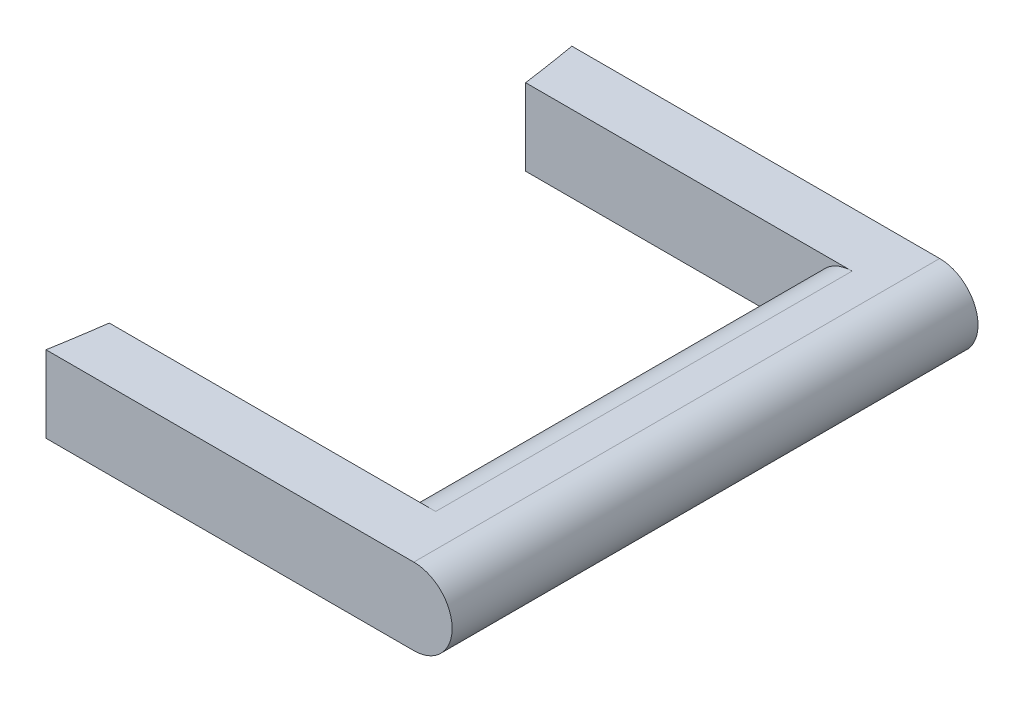
ISO-10303-21;
HEADER;
FILE_DESCRIPTION(('STEP AP214'),'2;1');
FILE_NAME('part.step','',(''),(''),'','','');
FILE_SCHEMA(('AUTOMOTIVE_DESIGN { 1 0 10303 214 1 1 1 1 }'));
ENDSEC;
DATA;
#1=APPLICATION_CONTEXT('core data for automotive mechanical design processes');
#2=APPLICATION_PROTOCOL_DEFINITION('international standard','automotive_design',2000,#1);
#3=PRODUCT_CONTEXT('',#1,'mechanical');
#4=PRODUCT('Part','Part','',(#3));
#5=PRODUCT_RELATED_PRODUCT_CATEGORY('part','',(#4));
#6=PRODUCT_DEFINITION_FORMATION('','',#4);
#7=PRODUCT_DEFINITION_CONTEXT('part definition',#1,'design');
#8=PRODUCT_DEFINITION('design','',#6,#7);
#9=PRODUCT_DEFINITION_SHAPE('','',#8);
#10=(LENGTH_UNIT() NAMED_UNIT(*) SI_UNIT(.MILLI.,.METRE.));
#11=(NAMED_UNIT(*) PLANE_ANGLE_UNIT() SI_UNIT($,.RADIAN.));
#12=(NAMED_UNIT(*) SI_UNIT($,.STERADIAN.) SOLID_ANGLE_UNIT());
#13=UNCERTAINTY_MEASURE_WITH_UNIT(LENGTH_MEASURE(1.E-05),#10,'distance_accuracy_value','');
#14=(GEOMETRIC_REPRESENTATION_CONTEXT(3) GLOBAL_UNCERTAINTY_ASSIGNED_CONTEXT((#13)) GLOBAL_UNIT_ASSIGNED_CONTEXT((#10,
#11,#12)) REPRESENTATION_CONTEXT('',''));
#15=CARTESIAN_POINT('',(0.,0.,0.));
#16=DIRECTION('',(0.,0.,1.));
#17=DIRECTION('',(1.,0.,0.));
#18=AXIS2_PLACEMENT_3D('',#15,#16,#17);
#19=CARTESIAN_POINT('',(168.5,3.5,-24.0000102421188));
#20=DIRECTION('',(0.,0.,-1.));
#21=DIRECTION('',(-1.,0.,0.));
#22=AXIS2_PLACEMENT_3D('',#19,#20,#21);
#23=CYLINDRICAL_SURFACE('',#22,3.5);
#24=DIRECTION('',(0.,0.,1.));
#25=VECTOR('',#24,1.);
#26=CARTESIAN_POINT('',(168.5,7.,-24.0000102421188));
#27=LINE('',#26,#25);
#28=CARTESIAN_POINT('',(168.5,7.,-19.000003374636));
#29=VERTEX_POINT('',#28);
#30=CARTESIAN_POINT('',(168.5,7.,19.));
#31=VERTEX_POINT('',#30);
#32=EDGE_CURVE('E160',#29,#31,#27,.T.);
#33=ORIENTED_EDGE('',*,*,#32,.F.);
#34=CARTESIAN_POINT('',(168.5,3.5,-19.000003374636));
#35=DIRECTION('',(0.,0.,1.));
#36=DIRECTION('',(1.,0.,0.));
#37=AXIS2_PLACEMENT_3D('',#34,#35,#36);
#38=CIRCLE('',#37,3.5);
#39=CARTESIAN_POINT('',(168.5,0.,-19.000003374636));
#40=VERTEX_POINT('',#39);
#41=EDGE_CURVE('E11',#40,#29,#38,.F.);
#42=ORIENTED_EDGE('',*,*,#41,.F.);
#43=DIRECTION('',(0.,0.,-1.));
#44=VECTOR('',#43,1.);
#45=CARTESIAN_POINT('',(168.5,0.,0.));
#46=LINE('',#45,#44);
#47=CARTESIAN_POINT('',(168.5,0.,19.));
#48=VERTEX_POINT('',#47);
#49=EDGE_CURVE('E162',#48,#40,#46,.T.);
#50=ORIENTED_EDGE('',*,*,#49,.F.);
#51=CARTESIAN_POINT('',(168.5,3.5,19.));
#52=DIRECTION('',(0.,0.,1.));
#53=DIRECTION('',(1.,0.,0.));
#54=AXIS2_PLACEMENT_3D('',#51,#52,#53);
#55=CIRCLE('',#54,3.5);
#56=EDGE_CURVE('E45',#31,#48,#55,.T.);
#57=ORIENTED_EDGE('',*,*,#56,.F.);
#58=EDGE_LOOP('',(#33,#42,#50,#57));
#59=FACE_BOUND('',#58,.T.);
#60=ADVANCED_FACE('F37',(#59),#23,.T.);
#61=CARTESIAN_POINT('',(171.5,3.5,24.000000935805));
#62=DIRECTION('',(0.,0.,1.));
#63=DIRECTION('',(1.,0.,0.));
#64=AXIS2_PLACEMENT_3D('',#61,#62,#63);
#65=CYLINDRICAL_SURFACE('',#64,3.5);
#66=DIRECTION('',(0.,0.,-1.));
#67=VECTOR('',#66,1.);
#68=CARTESIAN_POINT('',(171.5,7.,24.000000935805));
#69=LINE('',#68,#67);
#70=CARTESIAN_POINT('',(171.5,7.,24.000000935805));
#71=VERTEX_POINT('',#70);
#72=CARTESIAN_POINT('',(171.5,7.,-24.0000102421188));
#73=VERTEX_POINT('',#72);
#74=EDGE_CURVE('E147',#71,#73,#69,.T.);
#75=ORIENTED_EDGE('',*,*,#74,.F.);
#76=CARTESIAN_POINT('',(171.5,3.5,24.000000935805));
#77=DIRECTION('',(2.67372862703696E-07,0.,0.999999999999964));
#78=DIRECTION('',(0.999999999999964,0.,-2.67372862703696E-07));
#79=AXIS2_PLACEMENT_3D('',#76,#77,#78);
#80=CIRCLE('',#79,3.5);
#81=CARTESIAN_POINT('',(171.5,0.,24.000000935805));
#82=VERTEX_POINT('',#81);
#83=EDGE_CURVE('E156',#82,#71,#80,.T.);
#84=ORIENTED_EDGE('',*,*,#83,.F.);
#85=DIRECTION('',(0.,0.,1.));
#86=VECTOR('',#85,1.);
#87=CARTESIAN_POINT('',(171.5,0.,0.));
#88=LINE('',#87,#86);
#89=CARTESIAN_POINT('',(171.5,0.,-24.0000102421188));
#90=VERTEX_POINT('',#89);
#91=EDGE_CURVE('E153',#90,#82,#88,.T.);
#92=ORIENTED_EDGE('',*,*,#91,.F.);
#93=CARTESIAN_POINT('',(171.5,3.5,-24.0000102421188));
#94=DIRECTION('',(0.,0.,-1.));
#95=DIRECTION('',(-1.,0.,0.));
#96=AXIS2_PLACEMENT_3D('',#93,#94,#95);
#97=CIRCLE('',#96,3.5);
#98=EDGE_CURVE('E158',#73,#90,#97,.T.);
#99=ORIENTED_EDGE('',*,*,#98,.F.);
#100=EDGE_LOOP('',(#75,#84,#92,#99));
#101=FACE_BOUND('',#100,.T.);
#102=ADVANCED_FACE('F176',(#101),#65,.T.);
#103=CARTESIAN_POINT('',(165.,7.,19.));
#104=DIRECTION('',(0.,0.,1.));
#105=DIRECTION('',(1.,0.,0.));
#106=AXIS2_PLACEMENT_3D('',#103,#104,#105);
#107=PLANE('',#106);
#108=DIRECTION('',(-1.,0.,0.));
#109=VECTOR('',#108,1.);
#110=CARTESIAN_POINT('',(165.,0.,19.));
#111=LINE('',#110,#109);
#112=CARTESIAN_POINT('',(138.704722342103,0.,19.));
#113=VERTEX_POINT('',#112);
#114=EDGE_CURVE('E59',#48,#113,#111,.T.);
#115=ORIENTED_EDGE('',*,*,#114,.T.);
#116=DIRECTION('',(0.,-1.,0.));
#117=VECTOR('',#116,1.);
#118=CARTESIAN_POINT('',(138.704722342103,7.,19.));
#119=LINE('',#118,#117);
#120=CARTESIAN_POINT('',(138.704722342103,7.,19.));
#121=VERTEX_POINT('',#120);
#122=EDGE_CURVE('E144',#121,#113,#119,.T.);
#123=ORIENTED_EDGE('',*,*,#122,.F.);
#124=DIRECTION('',(-1.,0.,0.));
#125=VECTOR('',#124,1.);
#126=CARTESIAN_POINT('',(165.,7.,19.));
#127=LINE('',#126,#125);
#128=EDGE_CURVE('E120',#31,#121,#127,.T.);
#129=ORIENTED_EDGE('',*,*,#128,.F.);
#130=ORIENTED_EDGE('',*,*,#56,.T.);
#131=EDGE_LOOP('',(#115,#123,#129,#130));
#132=FACE_BOUND('',#131,.T.);
#133=ADVANCED_FACE('F166',(#132),#107,.F.);
#134=CARTESIAN_POINT('',(0.,7.,0.));
#135=DIRECTION('',(0.,-1.,0.));
#136=DIRECTION('',(0.,0.,-1.));
#137=AXIS2_PLACEMENT_3D('',#134,#135,#136);
#138=CYLINDRICAL_SURFACE('',#137,140.);
#139=CARTESIAN_POINT('',(0.,0.,0.));
#140=DIRECTION('',(0.,-1.,0.));
#141=DIRECTION('',(0.,0.,-1.));
#142=AXIS2_PLACEMENT_3D('',#139,#140,#141);
#143=CIRCLE('',#142,140.);
#144=CARTESIAN_POINT('',(137.92751547177,0.,24.0000099121763));
#145=VERTEX_POINT('',#144);
#146=EDGE_CURVE('E125',#113,#145,#143,.T.);
#147=ORIENTED_EDGE('',*,*,#146,.T.);
#148=DIRECTION('',(0.,-1.,0.));
#149=VECTOR('',#148,1.);
#150=CARTESIAN_POINT('',(137.92751547177,7.,24.0000099121763));
#151=LINE('',#150,#149);
#152=CARTESIAN_POINT('',(137.92751547177,7.,24.0000099121763));
#153=VERTEX_POINT('',#152);
#154=EDGE_CURVE('E148',#153,#145,#151,.T.);
#155=ORIENTED_EDGE('',*,*,#154,.F.);
#156=CARTESIAN_POINT('',(0.,7.,0.));
#157=DIRECTION('',(0.,-1.,0.));
#158=DIRECTION('',(0.,0.,-1.));
#159=AXIS2_PLACEMENT_3D('',#156,#157,#158);
#160=CIRCLE('',#159,140.);
#161=EDGE_CURVE('E131',#121,#153,#160,.T.);
#162=ORIENTED_EDGE('',*,*,#161,.F.);
#163=ORIENTED_EDGE('',*,*,#122,.T.);
#164=EDGE_LOOP('',(#147,#155,#162,#163));
#165=FACE_BOUND('',#164,.T.);
#166=ADVANCED_FACE('F184',(#165),#138,.F.);
#167=CARTESIAN_POINT('',(175.,7.,24.));
#168=DIRECTION('',(2.67372862703696E-07,0.,0.999999999999964));
#169=DIRECTION('',(0.999999999999964,0.,-2.67372862703696E-07));
#170=AXIS2_PLACEMENT_3D('',#167,#168,#169);
#171=PLANE('',#170);
#172=DIRECTION('',(-0.999999999999964,0.,2.67372862703696E-07));
#173=VECTOR('',#172,1.);
#174=CARTESIAN_POINT('',(175.,0.,24.));
#175=LINE('',#174,#173);
#176=EDGE_CURVE('E140',#82,#145,#175,.T.);
#177=ORIENTED_EDGE('',*,*,#176,.F.);
#178=ORIENTED_EDGE('',*,*,#83,.T.);
#179=DIRECTION('',(-0.999999999999964,0.,2.67372862703696E-07));
#180=VECTOR('',#179,1.);
#181=CARTESIAN_POINT('',(175.,7.,24.));
#182=LINE('',#181,#180);
#183=EDGE_CURVE('E129',#71,#153,#182,.T.);
#184=ORIENTED_EDGE('',*,*,#183,.T.);
#185=ORIENTED_EDGE('',*,*,#154,.T.);
#186=EDGE_LOOP('',(#177,#178,#184,#185));
#187=FACE_BOUND('',#186,.T.);
#188=ADVANCED_FACE('F179',(#187),#171,.T.);
#189=CARTESIAN_POINT('',(137.927515414359,7.,-24.0000102421188));
#190=DIRECTION('',(0.,0.,-1.));
#191=DIRECTION('',(-1.,0.,0.));
#192=AXIS2_PLACEMENT_3D('',#189,#190,#191);
#193=PLANE('',#192);
#194=DIRECTION('',(1.,0.,0.));
#195=VECTOR('',#194,1.);
#196=CARTESIAN_POINT('',(137.927515414359,7.,-24.0000102421188));
#197=LINE('',#196,#195);
#198=CARTESIAN_POINT('',(137.927515414359,7.,-24.0000102421188));
#199=VERTEX_POINT('',#198);
#200=EDGE_CURVE('E111',#199,#73,#197,.T.);
#201=ORIENTED_EDGE('',*,*,#200,.T.);
#202=ORIENTED_EDGE('',*,*,#98,.T.);
#203=DIRECTION('',(1.,0.,0.));
#204=VECTOR('',#203,1.);
#205=CARTESIAN_POINT('',(137.927515414359,0.,-24.0000102421188));
#206=LINE('',#205,#204);
#207=CARTESIAN_POINT('',(137.927515414359,0.,-24.0000102421188));
#208=VERTEX_POINT('',#207);
#209=EDGE_CURVE('E137',#208,#90,#206,.T.);
#210=ORIENTED_EDGE('',*,*,#209,.F.);
#211=DIRECTION('',(0.,-1.,0.));
#212=VECTOR('',#211,1.);
#213=CARTESIAN_POINT('',(137.927515414359,7.,-24.0000102421188));
#214=LINE('',#213,#212);
#215=EDGE_CURVE('E119',#199,#208,#214,.T.);
#216=ORIENTED_EDGE('',*,*,#215,.F.);
#217=EDGE_LOOP('',(#201,#202,#210,#216));
#218=FACE_BOUND('',#217,.T.);
#219=ADVANCED_FACE('F172',(#218),#193,.T.);
#220=CARTESIAN_POINT('',(0.,7.,0.));
#221=DIRECTION('',(0.,-1.,0.));
#222=DIRECTION('',(0.,0.,-1.));
#223=AXIS2_PLACEMENT_3D('',#220,#221,#222);
#224=CYLINDRICAL_SURFACE('',#223,140.);
#225=CARTESIAN_POINT('',(0.,0.,0.));
#226=DIRECTION('',(0.,-1.,0.));
#227=DIRECTION('',(0.,0.,-1.));
#228=AXIS2_PLACEMENT_3D('',#225,#226,#227);
#229=CIRCLE('',#228,140.);
#230=CARTESIAN_POINT('',(138.70472187984,0.,-19.000003374636));
#231=VERTEX_POINT('',#230);
#232=EDGE_CURVE('E118',#208,#231,#229,.T.);
#233=ORIENTED_EDGE('',*,*,#232,.T.);
#234=DIRECTION('',(0.,-1.,0.));
#235=VECTOR('',#234,1.);
#236=CARTESIAN_POINT('',(138.70472187984,7.,-19.000003374636));
#237=LINE('',#236,#235);
#238=CARTESIAN_POINT('',(138.70472187984,7.,-19.000003374636));
#239=VERTEX_POINT('',#238);
#240=EDGE_CURVE('E115',#239,#231,#237,.T.);
#241=ORIENTED_EDGE('',*,*,#240,.F.);
#242=CARTESIAN_POINT('',(0.,7.,0.));
#243=DIRECTION('',(0.,-1.,0.));
#244=DIRECTION('',(0.,0.,-1.));
#245=AXIS2_PLACEMENT_3D('',#242,#243,#244);
#246=CIRCLE('',#245,140.);
#247=EDGE_CURVE('E103',#199,#239,#246,.T.);
#248=ORIENTED_EDGE('',*,*,#247,.F.);
#249=ORIENTED_EDGE('',*,*,#215,.T.);
#250=EDGE_LOOP('',(#233,#241,#248,#249));
#251=FACE_BOUND('',#250,.T.);
#252=ADVANCED_FACE('F116',(#251),#224,.F.);
#253=CARTESIAN_POINT('',(165.,7.,-19.000003374636));
#254=DIRECTION('',(0.,0.,1.));
#255=DIRECTION('',(1.,0.,0.));
#256=AXIS2_PLACEMENT_3D('',#253,#254,#255);
#257=PLANE('',#256);
#258=DIRECTION('',(-1.,0.,0.));
#259=VECTOR('',#258,1.);
#260=CARTESIAN_POINT('',(165.,0.,-19.000003374636));
#261=LINE('',#260,#259);
#262=EDGE_CURVE('E51',#40,#231,#261,.T.);
#263=ORIENTED_EDGE('',*,*,#262,.F.);
#264=ORIENTED_EDGE('',*,*,#41,.T.);
#265=DIRECTION('',(-1.,0.,0.));
#266=VECTOR('',#265,1.);
#267=CARTESIAN_POINT('',(165.,7.,-19.000003374636));
#268=LINE('',#267,#266);
#269=EDGE_CURVE('E108',#29,#239,#268,.T.);
#270=ORIENTED_EDGE('',*,*,#269,.T.);
#271=ORIENTED_EDGE('',*,*,#240,.T.);
#272=EDGE_LOOP('',(#263,#264,#270,#271));
#273=FACE_BOUND('',#272,.T.);
#274=ADVANCED_FACE('F122',(#273),#257,.T.);
#275=CARTESIAN_POINT('',(0.,7.,0.));
#276=DIRECTION('',(0.,-1.,0.));
#277=DIRECTION('',(0.,0.,-1.));
#278=AXIS2_PLACEMENT_3D('',#275,#276,#277);
#279=PLANE('',#278);
#280=ORIENTED_EDGE('',*,*,#269,.F.);
#281=ORIENTED_EDGE('',*,*,#32,.T.);
#282=ORIENTED_EDGE('',*,*,#128,.T.);
#283=ORIENTED_EDGE('',*,*,#161,.T.);
#284=ORIENTED_EDGE('',*,*,#183,.F.);
#285=ORIENTED_EDGE('',*,*,#74,.T.);
#286=ORIENTED_EDGE('',*,*,#200,.F.);
#287=ORIENTED_EDGE('',*,*,#247,.T.);
#288=EDGE_LOOP('',(#280,#281,#282,#283,#284,#285,#286,#287));
#289=FACE_BOUND('',#288,.T.);
#290=ADVANCED_FACE('F105',(#289),#279,.F.);
#291=CARTESIAN_POINT('',(0.,0.,0.));
#292=DIRECTION('',(0.,-1.,0.));
#293=DIRECTION('',(0.,0.,-1.));
#294=AXIS2_PLACEMENT_3D('',#291,#292,#293);
#295=PLANE('',#294);
#296=ORIENTED_EDGE('',*,*,#49,.T.);
#297=ORIENTED_EDGE('',*,*,#262,.T.);
#298=ORIENTED_EDGE('',*,*,#232,.F.);
#299=ORIENTED_EDGE('',*,*,#209,.T.);
#300=ORIENTED_EDGE('',*,*,#91,.T.);
#301=ORIENTED_EDGE('',*,*,#176,.T.);
#302=ORIENTED_EDGE('',*,*,#146,.F.);
#303=ORIENTED_EDGE('',*,*,#114,.F.);
#304=EDGE_LOOP('',(#296,#297,#298,#299,#300,#301,#302,#303));
#305=FACE_BOUND('',#304,.T.);
#306=ADVANCED_FACE('F169',(#305),#295,.T.);
#307=CLOSED_SHELL('',(#60,#102,#133,#166,#188,#219,#252,#274,#290,#306));
#308=MANIFOLD_SOLID_BREP('B2',#307);
#309=ADVANCED_BREP_SHAPE_REPRESENTATION('',(#18,#308),#14);
#310=SHAPE_DEFINITION_REPRESENTATION(#9,#309);
ENDSEC;
END-ISO-10303-21;
